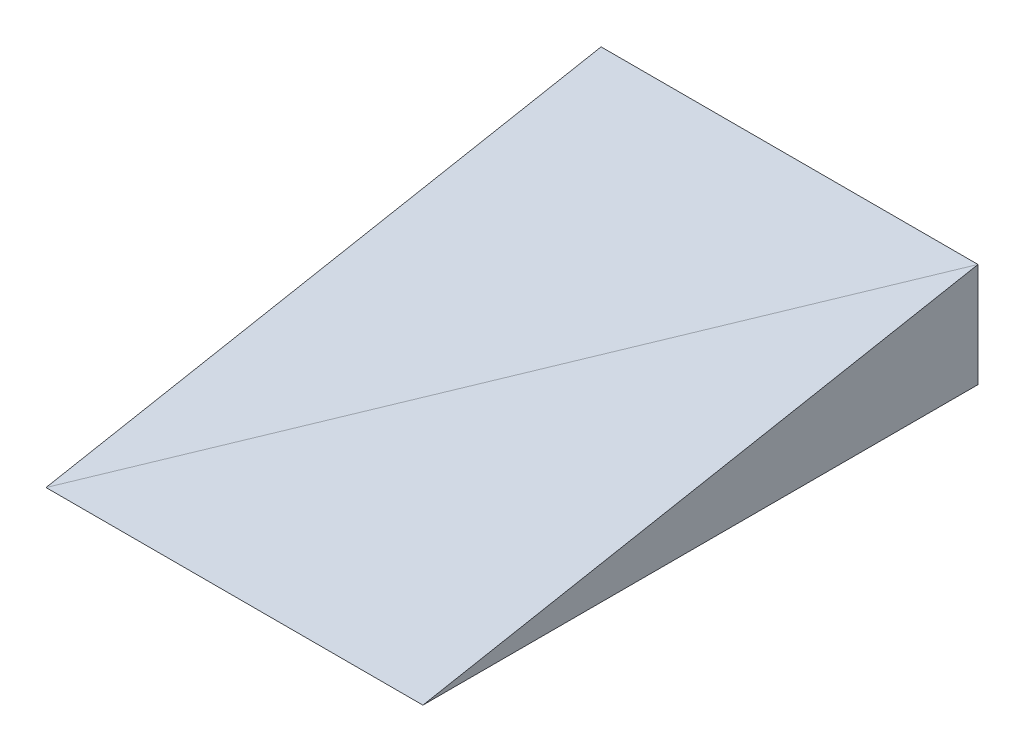
ISO-10303-21;
HEADER;
FILE_DESCRIPTION(('STEP AP214'),'2;1');
FILE_NAME('part.step','',(''),(''),'','','');
FILE_SCHEMA(('AUTOMOTIVE_DESIGN { 1 0 10303 214 1 1 1 1 }'));
ENDSEC;
DATA;
#1=APPLICATION_CONTEXT('core data for automotive mechanical design processes');
#2=APPLICATION_PROTOCOL_DEFINITION('international standard','automotive_design',2000,#1);
#3=PRODUCT_CONTEXT('',#1,'mechanical');
#4=PRODUCT('Part','Part','',(#3));
#5=PRODUCT_RELATED_PRODUCT_CATEGORY('part','',(#4));
#6=PRODUCT_DEFINITION_FORMATION('','',#4);
#7=PRODUCT_DEFINITION_CONTEXT('part definition',#1,'design');
#8=PRODUCT_DEFINITION('design','',#6,#7);
#9=PRODUCT_DEFINITION_SHAPE('','',#8);
#10=(LENGTH_UNIT() NAMED_UNIT(*) SI_UNIT(.MILLI.,.METRE.));
#11=(NAMED_UNIT(*) PLANE_ANGLE_UNIT() SI_UNIT($,.RADIAN.));
#12=(NAMED_UNIT(*) SI_UNIT($,.STERADIAN.) SOLID_ANGLE_UNIT());
#13=UNCERTAINTY_MEASURE_WITH_UNIT(LENGTH_MEASURE(1.E-05),#10,'distance_accuracy_value','');
#14=(GEOMETRIC_REPRESENTATION_CONTEXT(3) GLOBAL_UNCERTAINTY_ASSIGNED_CONTEXT((#13)) GLOBAL_UNIT_ASSIGNED_CONTEXT((#10,
#11,#12)) REPRESENTATION_CONTEXT('',''));
#15=CARTESIAN_POINT('',(0.,0.,0.));
#16=DIRECTION('',(0.,0.,1.));
#17=DIRECTION('',(1.,0.,0.));
#18=AXIS2_PLACEMENT_3D('',#15,#16,#17);
#19=CARTESIAN_POINT('',(0.,0.,0.));
#20=DIRECTION('',(0.,0.,1.));
#21=DIRECTION('',(0.,-1.,0.));
#22=AXIS2_PLACEMENT_3D('',#19,#20,#21);
#23=PLANE('',#22);
#24=DIRECTION('',(0.,-1.,0.));
#25=VECTOR('',#24,1.);
#26=CARTESIAN_POINT('',(119.999995231628,0.,0.));
#27=LINE('',#26,#25);
#28=CARTESIAN_POINT('',(119.999995231628,2.76153859996937,0.));
#29=VERTEX_POINT('',#28);
#30=CARTESIAN_POINT('',(119.999995231628,0.,0.));
#31=VERTEX_POINT('',#30);
#32=EDGE_CURVE('E50',#29,#31,#27,.T.);
#33=ORIENTED_EDGE('',*,*,#32,.F.);
#34=DIRECTION('',(-0.963920479902198,0.266190361255092,0.));
#35=VECTOR('',#34,1.);
#36=CARTESIAN_POINT('',(129.999995231628,0.,0.));
#37=LINE('',#36,#35);
#38=CARTESIAN_POINT('',(129.999995231628,0.,0.));
#39=VERTEX_POINT('',#38);
#40=EDGE_CURVE('E132',#39,#29,#37,.T.);
#41=ORIENTED_EDGE('',*,*,#40,.F.);
#42=DIRECTION('',(1.,0.,0.));
#43=VECTOR('',#42,1.);
#44=CARTESIAN_POINT('',(0.,0.,0.));
#45=LINE('',#44,#43);
#46=EDGE_CURVE('E110',#31,#39,#45,.T.);
#47=ORIENTED_EDGE('',*,*,#46,.F.);
#48=EDGE_LOOP('',(#33,#41,#47));
#49=FACE_BOUND('',#48,.T.);
#50=ADVANCED_FACE('F46',(#49),#23,.F.);
#51=DIRECTION('',(1.,0.,0.));
#52=VECTOR('',#51,1.);
#53=CARTESIAN_POINT('',(119.999995231628,25.9000004827976,0.));
#54=LINE('',#53,#52);
#55=CARTESIAN_POINT('',(10.,25.9000004827976,0.));
#56=VERTEX_POINT('',#55);
#57=CARTESIAN_POINT('',(36.2116973491186,25.9000004827976,0.));
#58=VERTEX_POINT('',#57);
#59=EDGE_CURVE('E100',#56,#58,#54,.T.);
#60=ORIENTED_EDGE('',*,*,#59,.F.);
#61=DIRECTION('',(0.,1.,0.));
#62=VECTOR('',#61,1.);
#63=CARTESIAN_POINT('',(10.,0.,0.));
#64=LINE('',#63,#62);
#65=CARTESIAN_POINT('',(10.,0.,0.));
#66=VERTEX_POINT('',#65);
#67=EDGE_CURVE('E170',#66,#56,#64,.T.);
#68=ORIENTED_EDGE('',*,*,#67,.F.);
#69=CARTESIAN_POINT('',(0.,0.,0.));
#70=VERTEX_POINT('',#69);
#71=EDGE_CURVE('E124',#70,#66,#45,.T.);
#72=ORIENTED_EDGE('',*,*,#71,.F.);
#73=DIRECTION('',(0.,1.,0.));
#74=VECTOR('',#73,1.);
#75=CARTESIAN_POINT('',(0.,0.,0.));
#76=LINE('',#75,#74);
#77=CARTESIAN_POINT('',(0.,35.9000004827976,1.00175423533104E-13));
#78=VERTEX_POINT('',#77);
#79=EDGE_CURVE('E169',#70,#78,#76,.T.);
#80=ORIENTED_EDGE('',*,*,#79,.T.);
#81=EDGE_CURVE('E91',#58,#78,#37,.T.);
#82=ORIENTED_EDGE('',*,*,#81,.F.);
#83=EDGE_LOOP('',(#60,#68,#72,#80,#82));
#84=FACE_BOUND('',#83,.T.);
#85=ADVANCED_FACE('F354',(#84),#23,.F.);
#86=CARTESIAN_POINT('',(0.,0.,0.));
#87=DIRECTION('',(0.,0.,-1.));
#88=DIRECTION('',(0.,1.,0.));
#89=AXIS2_PLACEMENT_3D('',#86,#87,#88);
#90=PLANE('',#89);
#91=ORIENTED_EDGE('',*,*,#40,.T.);
#92=CARTESIAN_POINT('',(119.999995231628,25.9000004827976,0.));
#93=VERTEX_POINT('',#92);
#94=EDGE_CURVE('E310',#93,#29,#27,.T.);
#95=ORIENTED_EDGE('',*,*,#94,.F.);
#96=EDGE_CURVE('E316',#58,#93,#54,.T.);
#97=ORIENTED_EDGE('',*,*,#96,.F.);
#98=ORIENTED_EDGE('',*,*,#81,.T.);
#99=DIRECTION('',(1.,0.,0.));
#100=VECTOR('',#99,1.);
#101=CARTESIAN_POINT('',(0.,35.9000004827976,1.23145937976126E-13));
#102=LINE('',#101,#100);
#103=CARTESIAN_POINT('',(129.999995231628,35.9000004827976,0.));
#104=VERTEX_POINT('',#103);
#105=EDGE_CURVE('E134',#78,#104,#102,.T.);
#106=ORIENTED_EDGE('',*,*,#105,.T.);
#107=DIRECTION('',(0.,1.,0.));
#108=VECTOR('',#107,1.);
#109=CARTESIAN_POINT('',(129.999995231628,0.,0.));
#110=LINE('',#109,#108);
#111=EDGE_CURVE('E129',#39,#104,#110,.T.);
#112=ORIENTED_EDGE('',*,*,#111,.F.);
#113=EDGE_LOOP('',(#91,#95,#97,#98,#106,#112));
#114=FACE_BOUND('',#113,.T.);
#115=ADVANCED_FACE('F130',(#114),#90,.T.);
#116=CARTESIAN_POINT('',(0.,0.,0.));
#117=DIRECTION('',(0.,-1.,0.));
#118=DIRECTION('',(0.,0.,-1.));
#119=AXIS2_PLACEMENT_3D('',#116,#117,#118);
#120=PLANE('',#119);
#121=ORIENTED_EDGE('',*,*,#71,.T.);
#122=DIRECTION('',(0.,0.,1.));
#123=VECTOR('',#122,1.);
#124=CARTESIAN_POINT('',(10.,0.,0.));
#125=LINE('',#124,#123);
#126=CARTESIAN_POINT('',(10.,0.,14.7281546676399));
#127=VERTEX_POINT('',#126);
#128=EDGE_CURVE('E12',#66,#127,#125,.T.);
#129=ORIENTED_EDGE('',*,*,#128,.T.);
#130=DIRECTION('',(-0.561728135106576,0.,-0.827321885501458));
#131=VECTOR('',#130,1.);
#132=CARTESIAN_POINT('',(129.999995231628,0.,191.466003656387));
#133=LINE('',#132,#131);
#134=EDGE_CURVE('E72',#127,#70,#133,.T.);
#135=ORIENTED_EDGE('',*,*,#134,.T.);
#136=EDGE_LOOP('',(#121,#129,#135));
#137=FACE_BOUND('',#136,.T.);
#138=ADVANCED_FACE('F362',(#137),#120,.T.);
#139=CARTESIAN_POINT('',(0.,0.,0.));
#140=DIRECTION('',(1.,0.,0.));
#141=DIRECTION('',(0.,0.,-1.));
#142=AXIS2_PLACEMENT_3D('',#139,#140,#141);
#143=PLANE('',#142);
#144=DIRECTION('',(0.,0.,-1.));
#145=VECTOR('',#144,1.);
#146=CARTESIAN_POINT('',(0.,0.,191.466003656387));
#147=LINE('',#146,#145);
#148=CARTESIAN_POINT('',(0.,0.,191.466003656387));
#149=VERTEX_POINT('',#148);
#150=EDGE_CURVE('E125',#149,#70,#147,.T.);
#151=ORIENTED_EDGE('',*,*,#150,.F.);
#152=DIRECTION('',(0.,-0.184289153927147,0.98287207089469));
#153=VECTOR('',#152,1.);
#154=CARTESIAN_POINT('',(0.,35.9000004827976,0.));
#155=LINE('',#154,#153);
#156=EDGE_CURVE('E165',#78,#149,#155,.T.);
#157=ORIENTED_EDGE('',*,*,#156,.F.);
#158=ORIENTED_EDGE('',*,*,#79,.F.);
#159=EDGE_LOOP('',(#151,#157,#158));
#160=FACE_BOUND('',#159,.T.);
#161=ADVANCED_FACE('F48',(#160),#143,.F.);
#162=CARTESIAN_POINT('',(0.,34.6807469944395,6.50266266631103));
#163=DIRECTION('',(0.,-0.98287207089469,-0.184289153927147));
#164=DIRECTION('',(0.,0.184289153927147,-0.98287207089469));
#165=AXIS2_PLACEMENT_3D('',#162,#163,#164);
#166=PLANE('',#165);
#167=ORIENTED_EDGE('',*,*,#156,.T.);
#168=DIRECTION('',(-0.555089206382578,-0.153290026985185,0.817543968594009));
#169=VECTOR('',#168,1.);
#170=CARTESIAN_POINT('',(129.999995231628,35.9000004827976,0.));
#171=LINE('',#170,#169);
#172=EDGE_CURVE('E144',#104,#149,#171,.T.);
#173=ORIENTED_EDGE('',*,*,#172,.F.);
#174=ORIENTED_EDGE('',*,*,#105,.F.);
#175=EDGE_LOOP('',(#167,#173,#174));
#176=FACE_BOUND('',#175,.T.);
#177=ADVANCED_FACE('F341',(#176),#166,.F.);
#178=CARTESIAN_POINT('',(0.,34.6807469944395,6.50266266631103));
#179=DIRECTION('',(0.,0.98287207089469,0.184289153927147));
#180=DIRECTION('',(0.,-0.184289153927147,0.98287207089469));
#181=AXIS2_PLACEMENT_3D('',#178,#179,#180);
#182=PLANE('',#181);
#183=DIRECTION('',(-1.,0.,0.));
#184=VECTOR('',#183,1.);
#185=CARTESIAN_POINT('',(129.999995231628,0.,191.466003656387));
#186=LINE('',#185,#184);
#187=CARTESIAN_POINT('',(129.999995231628,0.,191.466003656387));
#188=VERTEX_POINT('',#187);
#189=EDGE_CURVE('E139',#188,#149,#186,.T.);
#190=ORIENTED_EDGE('',*,*,#189,.F.);
#191=DIRECTION('',(0.,-0.184289153927147,0.98287207089469));
#192=VECTOR('',#191,1.);
#193=CARTESIAN_POINT('',(129.999995231628,35.9000004827976,1.23145937976126E-13));
#194=LINE('',#193,#192);
#195=EDGE_CURVE('E140',#104,#188,#194,.T.);
#196=ORIENTED_EDGE('',*,*,#195,.F.);
#197=ORIENTED_EDGE('',*,*,#172,.T.);
#198=EDGE_LOOP('',(#190,#196,#197));
#199=FACE_BOUND('',#198,.T.);
#200=ADVANCED_FACE('F343',(#199),#182,.T.);
#201=CARTESIAN_POINT('',(129.999995231628,0.,0.));
#202=DIRECTION('',(1.,0.,0.));
#203=DIRECTION('',(0.,0.,-1.));
#204=AXIS2_PLACEMENT_3D('',#201,#202,#203);
#205=PLANE('',#204);
#206=DIRECTION('',(0.,0.,1.));
#207=VECTOR('',#206,1.);
#208=CARTESIAN_POINT('',(129.999995231628,0.,0.));
#209=LINE('',#208,#207);
#210=EDGE_CURVE('E116',#39,#188,#209,.T.);
#211=ORIENTED_EDGE('',*,*,#210,.F.);
#212=ORIENTED_EDGE('',*,*,#111,.T.);
#213=ORIENTED_EDGE('',*,*,#195,.T.);
#214=EDGE_LOOP('',(#211,#212,#213));
#215=FACE_BOUND('',#214,.T.);
#216=ADVANCED_FACE('F146',(#215),#205,.T.);
#217=CARTESIAN_POINT('',(0.,0.,0.));
#218=DIRECTION('',(0.,1.,0.));
#219=DIRECTION('',(0.,0.,1.));
#220=AXIS2_PLACEMENT_3D('',#217,#218,#219);
#221=PLANE('',#220);
#222=DIRECTION('',(0.,0.,-1.));
#223=VECTOR('',#222,1.);
#224=CARTESIAN_POINT('',(10.,-5.13312691585294E-13,150.));
#225=LINE('',#224,#223);
#226=CARTESIAN_POINT('',(10.,-5.13312691585294E-13,150.));
#227=VERTEX_POINT('',#226);
#228=EDGE_CURVE('E65',#227,#127,#225,.T.);
#229=ORIENTED_EDGE('',*,*,#228,.F.);
#230=DIRECTION('',(-1.,0.,0.));
#231=VECTOR('',#230,1.);
#232=CARTESIAN_POINT('',(119.999995231628,-5.13312691585294E-13,150.));
#233=LINE('',#232,#231);
#234=CARTESIAN_POINT('',(101.845752835264,-5.12801425166654E-13,150.));
#235=VERTEX_POINT('',#234);
#236=EDGE_CURVE('E255',#235,#227,#233,.T.);
#237=ORIENTED_EDGE('',*,*,#236,.F.);
#238=EDGE_CURVE('E57',#188,#235,#133,.T.);
#239=ORIENTED_EDGE('',*,*,#238,.F.);
#240=ORIENTED_EDGE('',*,*,#189,.T.);
#241=ORIENTED_EDGE('',*,*,#150,.T.);
#242=ORIENTED_EDGE('',*,*,#134,.F.);
#243=EDGE_LOOP('',(#229,#237,#239,#240,#241,#242));
#244=FACE_BOUND('',#243,.T.);
#245=ADVANCED_FACE('F337',(#244),#221,.F.);
#246=CARTESIAN_POINT('',(119.999995231628,-5.13312691585294E-13,150.));
#247=VERTEX_POINT('',#246);
#248=EDGE_CURVE('E190',#247,#235,#233,.T.);
#249=ORIENTED_EDGE('',*,*,#248,.F.);
#250=DIRECTION('',(0.,0.,-1.));
#251=VECTOR('',#250,1.);
#252=CARTESIAN_POINT('',(119.999995231628,-5.13312691585294E-13,150.));
#253=LINE('',#252,#251);
#254=EDGE_CURVE('E119',#247,#31,#253,.T.);
#255=ORIENTED_EDGE('',*,*,#254,.T.);
#256=ORIENTED_EDGE('',*,*,#46,.T.);
#257=ORIENTED_EDGE('',*,*,#210,.T.);
#258=ORIENTED_EDGE('',*,*,#238,.T.);
#259=EDGE_LOOP('',(#249,#255,#256,#257,#258));
#260=FACE_BOUND('',#259,.T.);
#261=ADVANCED_FACE('F113',(#260),#120,.T.);
#262=CARTESIAN_POINT('',(0.,-8.32667268468867E-13,150.));
#263=DIRECTION('',(0.,0.,1.));
#264=DIRECTION('',(0.,-1.,0.));
#265=AXIS2_PLACEMENT_3D('',#262,#263,#264);
#266=PLANE('',#265);
#267=DIRECTION('',(0.,-1.,0.));
#268=VECTOR('',#267,1.);
#269=CARTESIAN_POINT('',(119.999995231628,-5.13312691585294E-13,150.));
#270=LINE('',#269,#268);
#271=CARTESIAN_POINT('',(119.999995231628,4.99999999999949,150.));
#272=VERTEX_POINT('',#271);
#273=EDGE_CURVE('E184',#272,#247,#270,.T.);
#274=ORIENTED_EDGE('',*,*,#273,.T.);
#275=ORIENTED_EDGE('',*,*,#248,.T.);
#276=ORIENTED_EDGE('',*,*,#236,.T.);
#277=DIRECTION('',(0.,1.,0.));
#278=VECTOR('',#277,1.);
#279=CARTESIAN_POINT('',(10.,-5.13312691585294E-13,150.));
#280=LINE('',#279,#278);
#281=CARTESIAN_POINT('',(10.,4.99999999999949,150.));
#282=VERTEX_POINT('',#281);
#283=EDGE_CURVE('E203',#227,#282,#280,.T.);
#284=ORIENTED_EDGE('',*,*,#283,.T.);
#285=DIRECTION('',(1.,0.,0.));
#286=VECTOR('',#285,1.);
#287=CARTESIAN_POINT('',(119.999995231628,4.99999999999949,150.));
#288=LINE('',#287,#286);
#289=EDGE_CURVE('E189',#282,#272,#288,.T.);
#290=ORIENTED_EDGE('',*,*,#289,.T.);
#291=EDGE_LOOP('',(#274,#275,#276,#284,#290));
#292=FACE_BOUND('',#291,.T.);
#293=ADVANCED_FACE('F211',(#292),#266,.F.);
#294=CARTESIAN_POINT('',(119.999995231628,0.,0.));
#295=DIRECTION('',(-1.,0.,0.));
#296=DIRECTION('',(0.,0.,1.));
#297=AXIS2_PLACEMENT_3D('',#294,#295,#296);
#298=PLANE('',#297);
#299=ORIENTED_EDGE('',*,*,#254,.F.);
#300=ORIENTED_EDGE('',*,*,#273,.F.);
#301=DIRECTION('',(0.,0.138000222753689,-0.990432197840888));
#302=VECTOR('',#301,1.);
#303=CARTESIAN_POINT('',(119.999995231628,4.99999999999949,150.));
#304=LINE('',#303,#302);
#305=EDGE_CURVE('E252',#272,#93,#304,.T.);
#306=ORIENTED_EDGE('',*,*,#305,.T.);
#307=ORIENTED_EDGE('',*,*,#94,.T.);
#308=ORIENTED_EDGE('',*,*,#32,.T.);
#309=EDGE_LOOP('',(#299,#300,#306,#307,#308));
#310=FACE_BOUND('',#309,.T.);
#311=ADVANCED_FACE('F220',(#310),#298,.T.);
#312=CARTESIAN_POINT('',(0.,25.4067592812695,3.54000854163245));
#313=DIRECTION('',(0.,-0.990432197840888,-0.138000222753689));
#314=DIRECTION('',(0.,0.138000222753689,-0.990432197840888));
#315=AXIS2_PLACEMENT_3D('',#312,#313,#314);
#316=PLANE('',#315);
#317=ORIENTED_EDGE('',*,*,#305,.F.);
#318=ORIENTED_EDGE('',*,*,#289,.F.);
#319=DIRECTION('',(0.,0.138000222753689,-0.990432197840888));
#320=VECTOR('',#319,1.);
#321=CARTESIAN_POINT('',(10.,4.99999999999949,150.));
#322=LINE('',#321,#320);
#323=EDGE_CURVE('E299',#282,#56,#322,.T.);
#324=ORIENTED_EDGE('',*,*,#323,.T.);
#325=ORIENTED_EDGE('',*,*,#59,.T.);
#326=ORIENTED_EDGE('',*,*,#96,.T.);
#327=EDGE_LOOP('',(#317,#318,#324,#325,#326));
#328=FACE_BOUND('',#327,.T.);
#329=ADVANCED_FACE('F279',(#328),#316,.T.);
#330=CARTESIAN_POINT('',(10.,0.,0.));
#331=DIRECTION('',(1.,0.,0.));
#332=DIRECTION('',(0.,0.,-1.));
#333=AXIS2_PLACEMENT_3D('',#330,#331,#332);
#334=PLANE('',#333);
#335=ORIENTED_EDGE('',*,*,#323,.F.);
#336=ORIENTED_EDGE('',*,*,#283,.F.);
#337=ORIENTED_EDGE('',*,*,#228,.T.);
#338=ORIENTED_EDGE('',*,*,#128,.F.);
#339=ORIENTED_EDGE('',*,*,#67,.T.);
#340=EDGE_LOOP('',(#335,#336,#337,#338,#339));
#341=FACE_BOUND('',#340,.T.);
#342=ADVANCED_FACE('F288',(#341),#334,.T.);
#343=CLOSED_SHELL('',(#50,#85,#115,#138,#161,#177,#200,#216,#245,#261,#293,#311,#329,#342));
#344=MANIFOLD_SOLID_BREP('B2',#343);
#345=ADVANCED_BREP_SHAPE_REPRESENTATION('',(#18,#344),#14);
#346=SHAPE_DEFINITION_REPRESENTATION(#9,#345);
ENDSEC;
END-ISO-10303-21;
